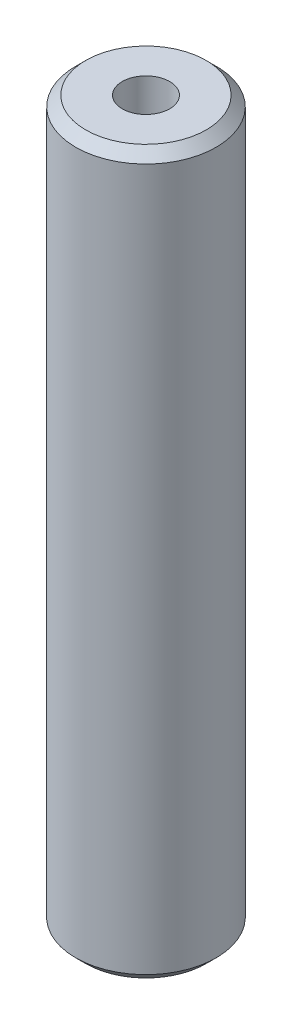
ISO-10303-21;
HEADER;
FILE_DESCRIPTION(('STEP AP214'),'2;1');
FILE_NAME('part.step','',(''),(''),'','','');
FILE_SCHEMA(('AUTOMOTIVE_DESIGN { 1 0 10303 214 1 1 1 1 }'));
ENDSEC;
DATA;
#1=APPLICATION_CONTEXT('core data for automotive mechanical design processes');
#2=APPLICATION_PROTOCOL_DEFINITION('international standard','automotive_design',2000,#1);
#3=PRODUCT_CONTEXT('',#1,'mechanical');
#4=PRODUCT('Part','Part','',(#3));
#5=PRODUCT_RELATED_PRODUCT_CATEGORY('part','',(#4));
#6=PRODUCT_DEFINITION_FORMATION('','',#4);
#7=PRODUCT_DEFINITION_CONTEXT('part definition',#1,'design');
#8=PRODUCT_DEFINITION('design','',#6,#7);
#9=PRODUCT_DEFINITION_SHAPE('','',#8);
#10=(LENGTH_UNIT() NAMED_UNIT(*) SI_UNIT(.MILLI.,.METRE.));
#11=(NAMED_UNIT(*) PLANE_ANGLE_UNIT() SI_UNIT($,.RADIAN.));
#12=(NAMED_UNIT(*) SI_UNIT($,.STERADIAN.) SOLID_ANGLE_UNIT());
#13=UNCERTAINTY_MEASURE_WITH_UNIT(LENGTH_MEASURE(1.E-05),#10,'distance_accuracy_value','');
#14=(GEOMETRIC_REPRESENTATION_CONTEXT(3) GLOBAL_UNCERTAINTY_ASSIGNED_CONTEXT((#13)) GLOBAL_UNIT_ASSIGNED_CONTEXT((#10,
#11,#12)) REPRESENTATION_CONTEXT('',''));
#15=CARTESIAN_POINT('',(0.,0.,0.));
#16=DIRECTION('',(0.,0.,1.));
#17=DIRECTION('',(1.,0.,0.));
#18=AXIS2_PLACEMENT_3D('',#15,#16,#17);
#19=CARTESIAN_POINT('',(0.,77.0906130117637,0.));
#20=DIRECTION('',(0.,-1.,0.));
#21=DIRECTION('',(0.,0.,-1.));
#22=AXIS2_PLACEMENT_3D('',#19,#20,#21);
#23=CYLINDRICAL_SURFACE('',#22,7.5);
#24=CARTESIAN_POINT('',(0.,76.0215058908904,0.));
#25=DIRECTION('',(0.,1.,0.));
#26=DIRECTION('',(0.,0.,1.));
#27=AXIS2_PLACEMENT_3D('',#24,#25,#26);
#28=CIRCLE('',#27,7.5);
#29=CARTESIAN_POINT('',(0.,76.0215058908904,7.5));
#30=VERTEX_POINT('',#29);
#31=EDGE_CURVE('E50',#30,#30,#28,.F.);
#32=ORIENTED_EDGE('',*,*,#31,.T.);
#33=EDGE_LOOP('',(#32));
#34=FACE_BOUND('',#33,.T.);
#35=CARTESIAN_POINT('',(0.,1.06910712087328,0.));
#36=DIRECTION('',(0.,1.,0.));
#37=DIRECTION('',(0.,0.,1.));
#38=AXIS2_PLACEMENT_3D('',#35,#36,#37);
#39=CIRCLE('',#38,7.5);
#40=CARTESIAN_POINT('',(0.,1.06910712087328,7.5));
#41=VERTEX_POINT('',#40);
#42=EDGE_CURVE('E51',#41,#41,#39,.T.);
#43=ORIENTED_EDGE('',*,*,#42,.T.);
#44=EDGE_LOOP('',(#43));
#45=FACE_BOUND('',#44,.T.);
#46=ADVANCED_FACE('F39',(#34,#45),#23,.T.);
#47=CARTESIAN_POINT('',(0.,77.0906130117637,0.));
#48=DIRECTION('',(0.,1.,0.));
#49=DIRECTION('',(0.,0.,1.));
#50=AXIS2_PLACEMENT_3D('',#47,#48,#49);
#51=PLANE('',#50);
#52=CARTESIAN_POINT('',(0.,77.0906130117637,0.));
#53=DIRECTION('',(0.,1.,0.));
#54=DIRECTION('',(0.,0.,1.));
#55=AXIS2_PLACEMENT_3D('',#52,#53,#54);
#56=CIRCLE('',#55,6.43089287912672);
#57=CARTESIAN_POINT('',(0.,77.0906130117637,6.43089287912672));
#58=VERTEX_POINT('',#57);
#59=EDGE_CURVE('E54',#58,#58,#56,.T.);
#60=ORIENTED_EDGE('',*,*,#59,.T.);
#61=EDGE_LOOP('',(#60));
#62=FACE_BOUND('',#61,.T.);
#63=CARTESIAN_POINT('',(0.,77.0906130117637,0.));
#64=DIRECTION('',(0.,1.,0.));
#65=DIRECTION('',(0.,0.,1.));
#66=AXIS2_PLACEMENT_3D('',#63,#64,#65);
#67=CIRCLE('',#66,2.52946180820208);
#68=CARTESIAN_POINT('',(0.,77.0906130117637,2.52946180820208));
#69=VERTEX_POINT('',#68);
#70=EDGE_CURVE('E58',#69,#69,#67,.T.);
#71=ORIENTED_EDGE('',*,*,#70,.F.);
#72=EDGE_LOOP('',(#71));
#73=FACE_BOUND('',#72,.T.);
#74=ADVANCED_FACE('F69',(#62,#73),#51,.T.);
#75=CARTESIAN_POINT('',(0.,0.,0.));
#76=DIRECTION('',(0.,1.,0.));
#77=DIRECTION('',(0.,0.,1.));
#78=AXIS2_PLACEMENT_3D('',#75,#76,#77);
#79=PLANE('',#78);
#80=CARTESIAN_POINT('',(0.,0.,0.));
#81=DIRECTION('',(0.,1.,0.));
#82=DIRECTION('',(0.,0.,1.));
#83=AXIS2_PLACEMENT_3D('',#80,#81,#82);
#84=CIRCLE('',#83,6.43089287912671);
#85=CARTESIAN_POINT('',(0.,0.,6.43089287912671));
#86=VERTEX_POINT('',#85);
#87=EDGE_CURVE('E10',#86,#86,#84,.F.);
#88=ORIENTED_EDGE('',*,*,#87,.T.);
#89=EDGE_LOOP('',(#88));
#90=FACE_BOUND('',#89,.T.);
#91=CARTESIAN_POINT('',(0.,0.,0.));
#92=DIRECTION('',(0.,1.,0.));
#93=DIRECTION('',(0.,0.,1.));
#94=AXIS2_PLACEMENT_3D('',#91,#92,#93);
#95=CIRCLE('',#94,2.52946180820208);
#96=CARTESIAN_POINT('',(0.,0.,2.52946180820208));
#97=VERTEX_POINT('',#96);
#98=EDGE_CURVE('E63',#97,#97,#95,.T.);
#99=ORIENTED_EDGE('',*,*,#98,.T.);
#100=EDGE_LOOP('',(#99));
#101=FACE_BOUND('',#100,.T.);
#102=ADVANCED_FACE('F75',(#90,#101),#79,.F.);
#103=CARTESIAN_POINT('',(0.,77.0906130117637,0.));
#104=DIRECTION('',(0.,-1.,0.));
#105=DIRECTION('',(0.,0.,-1.));
#106=AXIS2_PLACEMENT_3D('',#103,#104,#105);
#107=CYLINDRICAL_SURFACE('',#106,2.52946180820208);
#108=ORIENTED_EDGE('',*,*,#70,.T.);
#109=EDGE_LOOP('',(#108));
#110=FACE_BOUND('',#109,.T.);
#111=ORIENTED_EDGE('',*,*,#98,.F.);
#112=EDGE_LOOP('',(#111));
#113=FACE_BOUND('',#112,.T.);
#114=ADVANCED_FACE('F70',(#110,#113),#107,.F.);
#115=CARTESIAN_POINT('',(0.,77.0906130117637,0.));
#116=DIRECTION('',(0.,-1.,0.));
#117=DIRECTION('',(0.,0.,-1.));
#118=AXIS2_PLACEMENT_3D('',#115,#116,#117);
#119=CONICAL_SURFACE('',#118,6.43089287912672,0.785398163397442);
#120=ORIENTED_EDGE('',*,*,#31,.F.);
#121=EDGE_LOOP('',(#120));
#122=FACE_BOUND('',#121,.T.);
#123=ORIENTED_EDGE('',*,*,#59,.F.);
#124=EDGE_LOOP('',(#123));
#125=FACE_BOUND('',#124,.T.);
#126=ADVANCED_FACE('F81',(#122,#125),#119,.T.);
#127=CARTESIAN_POINT('',(0.,1.06910712087328,0.));
#128=DIRECTION('',(0.,1.,0.));
#129=DIRECTION('',(0.,0.,1.));
#130=AXIS2_PLACEMENT_3D('',#127,#128,#129);
#131=CONICAL_SURFACE('',#130,7.5,0.785398163397451);
#132=ORIENTED_EDGE('',*,*,#87,.F.);
#133=EDGE_LOOP('',(#132));
#134=FACE_BOUND('',#133,.T.);
#135=ORIENTED_EDGE('',*,*,#42,.F.);
#136=EDGE_LOOP('',(#135));
#137=FACE_BOUND('',#136,.T.);
#138=ADVANCED_FACE('F45',(#134,#137),#131,.T.);
#139=CLOSED_SHELL('',(#46,#74,#102,#114,#126,#138));
#140=MANIFOLD_SOLID_BREP('B2',#139);
#141=ADVANCED_BREP_SHAPE_REPRESENTATION('',(#18,#140),#14);
#142=SHAPE_DEFINITION_REPRESENTATION(#9,#141);
ENDSEC;
END-ISO-10303-21;
